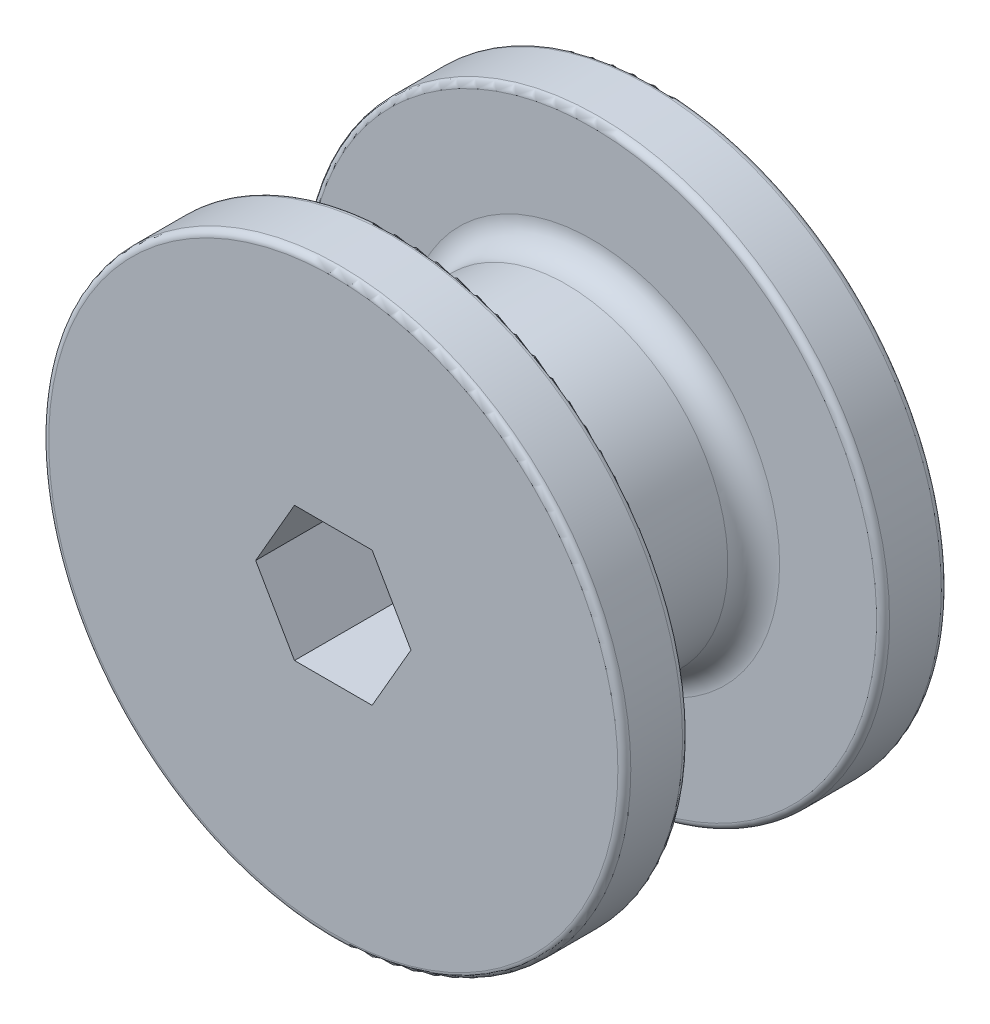
ISO-10303-21;
HEADER;
FILE_DESCRIPTION(('STEP AP214'),'2;1');
FILE_NAME('part.step','',(''),(''),'','','');
FILE_SCHEMA(('AUTOMOTIVE_DESIGN { 1 0 10303 214 1 1 1 1 }'));
ENDSEC;
DATA;
#1=APPLICATION_CONTEXT('core data for automotive mechanical design processes');
#2=APPLICATION_PROTOCOL_DEFINITION('international standard','automotive_design',2000,#1);
#3=PRODUCT_CONTEXT('',#1,'mechanical');
#4=PRODUCT('Part','Part','',(#3));
#5=PRODUCT_RELATED_PRODUCT_CATEGORY('part','',(#4));
#6=PRODUCT_DEFINITION_FORMATION('','',#4);
#7=PRODUCT_DEFINITION_CONTEXT('part definition',#1,'design');
#8=PRODUCT_DEFINITION('design','',#6,#7);
#9=PRODUCT_DEFINITION_SHAPE('','',#8);
#10=(LENGTH_UNIT() NAMED_UNIT(*) SI_UNIT(.MILLI.,.METRE.));
#11=(NAMED_UNIT(*) PLANE_ANGLE_UNIT() SI_UNIT($,.RADIAN.));
#12=(NAMED_UNIT(*) SI_UNIT($,.STERADIAN.) SOLID_ANGLE_UNIT());
#13=UNCERTAINTY_MEASURE_WITH_UNIT(LENGTH_MEASURE(1.E-05),#10,'distance_accuracy_value','');
#14=(GEOMETRIC_REPRESENTATION_CONTEXT(3) GLOBAL_UNCERTAINTY_ASSIGNED_CONTEXT((#13)) GLOBAL_UNIT_ASSIGNED_CONTEXT((#10,
#11,#12)) REPRESENTATION_CONTEXT('',''));
#15=CARTESIAN_POINT('',(0.,0.,0.));
#16=DIRECTION('',(0.,0.,1.));
#17=DIRECTION('',(1.,0.,0.));
#18=AXIS2_PLACEMENT_3D('',#15,#16,#17);
#19=CARTESIAN_POINT('',(0.,0.,19.05));
#20=DIRECTION('',(0.,0.,-1.));
#21=DIRECTION('',(-1.,0.,0.));
#22=AXIS2_PLACEMENT_3D('',#19,#20,#21);
#23=CYLINDRICAL_SURFACE('',#22,15.875);
#24=CARTESIAN_POINT('',(0.,0.,16.51));
#25=DIRECTION('',(0.,0.,1.));
#26=DIRECTION('',(1.,0.,0.));
#27=AXIS2_PLACEMENT_3D('',#24,#25,#26);
#28=CIRCLE('',#27,15.875);
#29=CARTESIAN_POINT('',(15.875,0.,16.51));
#30=VERTEX_POINT('',#29);
#31=EDGE_CURVE('E143',#30,#30,#28,.F.);
#32=ORIENTED_EDGE('',*,*,#31,.T.);
#33=EDGE_LOOP('',(#32));
#34=FACE_BOUND('',#33,.T.);
#35=CARTESIAN_POINT('',(0.,0.,2.54));
#36=DIRECTION('',(0.,0.,-1.));
#37=DIRECTION('',(-1.,0.,0.));
#38=AXIS2_PLACEMENT_3D('',#35,#36,#37);
#39=CIRCLE('',#38,15.875);
#40=CARTESIAN_POINT('',(-15.875,0.,2.54));
#41=VERTEX_POINT('',#40);
#42=EDGE_CURVE('E140',#41,#41,#39,.F.);
#43=ORIENTED_EDGE('',*,*,#42,.T.);
#44=EDGE_LOOP('',(#43));
#45=FACE_BOUND('',#44,.T.);
#46=ADVANCED_FACE('F33',(#34,#45),#23,.T.);
#47=CARTESIAN_POINT('',(0.,0.,25.4));
#48=DIRECTION('',(0.,0.,-1.));
#49=DIRECTION('',(-1.,0.,0.));
#50=AXIS2_PLACEMENT_3D('',#47,#48,#49);
#51=CYLINDRICAL_SURFACE('',#50,28.575);
#52=CARTESIAN_POINT('',(0.,0.,24.765));
#53=DIRECTION('',(0.,0.,1.));
#54=DIRECTION('',(1.,0.,0.));
#55=AXIS2_PLACEMENT_3D('',#52,#53,#54);
#56=CIRCLE('',#55,28.575);
#57=CARTESIAN_POINT('',(28.575,0.,24.765));
#58=VERTEX_POINT('',#57);
#59=EDGE_CURVE('E155',#58,#58,#56,.F.);
#60=ORIENTED_EDGE('',*,*,#59,.T.);
#61=EDGE_LOOP('',(#60));
#62=FACE_BOUND('',#61,.T.);
#63=CARTESIAN_POINT('',(0.,0.,19.685));
#64=DIRECTION('',(0.,0.,1.));
#65=DIRECTION('',(1.,0.,0.));
#66=AXIS2_PLACEMENT_3D('',#63,#64,#65);
#67=CIRCLE('',#66,28.575);
#68=CARTESIAN_POINT('',(28.575,0.,19.685));
#69=VERTEX_POINT('',#68);
#70=EDGE_CURVE('E152',#69,#69,#67,.T.);
#71=ORIENTED_EDGE('',*,*,#70,.T.);
#72=EDGE_LOOP('',(#71));
#73=FACE_BOUND('',#72,.T.);
#74=ADVANCED_FACE('F205',(#62,#73),#51,.T.);
#75=CARTESIAN_POINT('',(0.,0.,25.4));
#76=DIRECTION('',(0.,0.,1.));
#77=DIRECTION('',(1.,0.,0.));
#78=AXIS2_PLACEMENT_3D('',#75,#76,#77);
#79=PLANE('',#78);
#80=CARTESIAN_POINT('',(0.,0.,25.4));
#81=DIRECTION('',(0.,0.,1.));
#82=DIRECTION('',(1.,0.,0.));
#83=AXIS2_PLACEMENT_3D('',#80,#81,#82);
#84=CIRCLE('',#83,27.94);
#85=CARTESIAN_POINT('',(27.94,0.,25.4));
#86=VERTEX_POINT('',#85);
#87=EDGE_CURVE('E149',#86,#86,#84,.T.);
#88=ORIENTED_EDGE('',*,*,#87,.T.);
#89=EDGE_LOOP('',(#88));
#90=FACE_BOUND('',#89,.T.);
#91=DIRECTION('',(-0.5,0.866025403784439,0.));
#92=VECTOR('',#91,1.);
#93=CARTESIAN_POINT('',(-3.81051177665153,-6.6,25.4));
#94=LINE('',#93,#92);
#95=CARTESIAN_POINT('',(-3.81051177665153,-6.6,25.4));
#96=VERTEX_POINT('',#95);
#97=CARTESIAN_POINT('',(-7.62102355330306,0.,25.4));
#98=VERTEX_POINT('',#97);
#99=EDGE_CURVE('E88',#96,#98,#94,.T.);
#100=ORIENTED_EDGE('',*,*,#99,.T.);
#101=DIRECTION('',(0.5,0.866025403784438,0.));
#102=VECTOR('',#101,1.);
#103=CARTESIAN_POINT('',(-7.62102355330306,0.,25.4));
#104=LINE('',#103,#102);
#105=CARTESIAN_POINT('',(-3.81051177665153,6.6,25.4));
#106=VERTEX_POINT('',#105);
#107=EDGE_CURVE('E97',#98,#106,#104,.T.);
#108=ORIENTED_EDGE('',*,*,#107,.T.);
#109=DIRECTION('',(1.,0.,0.));
#110=VECTOR('',#109,1.);
#111=CARTESIAN_POINT('',(-3.81051177665153,6.6,25.4));
#112=LINE('',#111,#110);
#113=CARTESIAN_POINT('',(3.81051177665153,6.6,25.4));
#114=VERTEX_POINT('',#113);
#115=EDGE_CURVE('E48',#106,#114,#112,.T.);
#116=ORIENTED_EDGE('',*,*,#115,.T.);
#117=DIRECTION('',(0.5,-0.866025403784439,0.));
#118=VECTOR('',#117,1.);
#119=CARTESIAN_POINT('',(3.81051177665153,6.6,25.4));
#120=LINE('',#119,#118);
#121=CARTESIAN_POINT('',(7.62102355330306,0.,25.4));
#122=VERTEX_POINT('',#121);
#123=EDGE_CURVE('E111',#114,#122,#120,.T.);
#124=ORIENTED_EDGE('',*,*,#123,.T.);
#125=DIRECTION('',(-0.5,-0.866025403784439,0.));
#126=VECTOR('',#125,1.);
#127=CARTESIAN_POINT('',(7.62102355330306,0.,25.4));
#128=LINE('',#127,#126);
#129=CARTESIAN_POINT('',(3.81051177665153,-6.6,25.4));
#130=VERTEX_POINT('',#129);
#131=EDGE_CURVE('E114',#122,#130,#128,.T.);
#132=ORIENTED_EDGE('',*,*,#131,.T.);
#133=DIRECTION('',(-1.,0.,0.));
#134=VECTOR('',#133,1.);
#135=CARTESIAN_POINT('',(3.81051177665153,-6.6,25.4));
#136=LINE('',#135,#134);
#137=EDGE_CURVE('E94',#130,#96,#136,.T.);
#138=ORIENTED_EDGE('',*,*,#137,.T.);
#139=EDGE_LOOP('',(#100,#108,#116,#124,#132,#138));
#140=FACE_BOUND('',#139,.T.);
#141=ADVANCED_FACE('F101',(#90,#140),#79,.T.);
#142=CARTESIAN_POINT('',(0.,0.,19.05));
#143=DIRECTION('',(0.,0.,1.));
#144=DIRECTION('',(1.,0.,0.));
#145=AXIS2_PLACEMENT_3D('',#142,#143,#144);
#146=PLANE('',#145);
#147=CARTESIAN_POINT('',(0.,0.,19.05));
#148=DIRECTION('',(0.,0.,1.));
#149=DIRECTION('',(1.,0.,0.));
#150=AXIS2_PLACEMENT_3D('',#147,#148,#149);
#151=CIRCLE('',#150,27.94);
#152=CARTESIAN_POINT('',(27.94,0.,19.05));
#153=VERTEX_POINT('',#152);
#154=EDGE_CURVE('E158',#153,#153,#151,.F.);
#155=ORIENTED_EDGE('',*,*,#154,.T.);
#156=EDGE_LOOP('',(#155));
#157=FACE_BOUND('',#156,.T.);
#158=CARTESIAN_POINT('',(0.,0.,19.05));
#159=DIRECTION('',(0.,0.,1.));
#160=DIRECTION('',(1.,0.,0.));
#161=AXIS2_PLACEMENT_3D('',#158,#159,#160);
#162=CIRCLE('',#161,18.415);
#163=CARTESIAN_POINT('',(18.415,0.,19.05));
#164=VERTEX_POINT('',#163);
#165=EDGE_CURVE('E130',#164,#164,#162,.T.);
#166=ORIENTED_EDGE('',*,*,#165,.T.);
#167=EDGE_LOOP('',(#166));
#168=FACE_BOUND('',#167,.T.);
#169=ADVANCED_FACE('F239',(#157,#168),#146,.F.);
#170=CARTESIAN_POINT('',(0.,0.,-6.35));
#171=DIRECTION('',(0.,0.,1.));
#172=DIRECTION('',(1.,0.,0.));
#173=AXIS2_PLACEMENT_3D('',#170,#171,#172);
#174=CYLINDRICAL_SURFACE('',#173,28.575);
#175=CARTESIAN_POINT('',(0.,0.,-5.715));
#176=DIRECTION('',(0.,0.,-1.));
#177=DIRECTION('',(-1.,0.,0.));
#178=AXIS2_PLACEMENT_3D('',#175,#176,#177);
#179=CIRCLE('',#178,28.575);
#180=CARTESIAN_POINT('',(-28.575,0.,-5.715));
#181=VERTEX_POINT('',#180);
#182=EDGE_CURVE('E41',#181,#181,#179,.F.);
#183=ORIENTED_EDGE('',*,*,#182,.T.);
#184=EDGE_LOOP('',(#183));
#185=FACE_BOUND('',#184,.T.);
#186=CARTESIAN_POINT('',(0.,0.,-0.635));
#187=DIRECTION('',(0.,0.,-1.));
#188=DIRECTION('',(-1.,0.,0.));
#189=AXIS2_PLACEMENT_3D('',#186,#187,#188);
#190=CIRCLE('',#189,28.575);
#191=CARTESIAN_POINT('',(-28.575,0.,-0.635));
#192=VERTEX_POINT('',#191);
#193=EDGE_CURVE('E164',#192,#192,#190,.T.);
#194=ORIENTED_EDGE('',*,*,#193,.T.);
#195=EDGE_LOOP('',(#194));
#196=FACE_BOUND('',#195,.T.);
#197=ADVANCED_FACE('F169',(#185,#196),#174,.T.);
#198=CARTESIAN_POINT('',(0.,0.,-6.35));
#199=DIRECTION('',(0.,0.,-1.));
#200=DIRECTION('',(-1.,0.,0.));
#201=AXIS2_PLACEMENT_3D('',#198,#199,#200);
#202=PLANE('',#201);
#203=CARTESIAN_POINT('',(0.,0.,-6.35));
#204=DIRECTION('',(0.,0.,-1.));
#205=DIRECTION('',(-1.,0.,0.));
#206=AXIS2_PLACEMENT_3D('',#203,#204,#205);
#207=CIRCLE('',#206,27.94);
#208=CARTESIAN_POINT('',(-27.94,0.,-6.35));
#209=VERTEX_POINT('',#208);
#210=EDGE_CURVE('E161',#209,#209,#207,.T.);
#211=ORIENTED_EDGE('',*,*,#210,.T.);
#212=EDGE_LOOP('',(#211));
#213=FACE_BOUND('',#212,.T.);
#214=DIRECTION('',(-0.5,0.866025403784439,0.));
#215=VECTOR('',#214,1.);
#216=CARTESIAN_POINT('',(-3.81051177665153,-6.6,-6.35));
#217=LINE('',#216,#215);
#218=CARTESIAN_POINT('',(-3.81051177665153,-6.6,-6.35));
#219=VERTEX_POINT('',#218);
#220=CARTESIAN_POINT('',(-7.62102355330306,0.,-6.35));
#221=VERTEX_POINT('',#220);
#222=EDGE_CURVE('E56',#219,#221,#217,.T.);
#223=ORIENTED_EDGE('',*,*,#222,.F.);
#224=DIRECTION('',(-1.,0.,0.));
#225=VECTOR('',#224,1.);
#226=CARTESIAN_POINT('',(3.81051177665153,-6.6,-6.35));
#227=LINE('',#226,#225);
#228=CARTESIAN_POINT('',(3.81051177665153,-6.6,-6.35));
#229=VERTEX_POINT('',#228);
#230=EDGE_CURVE('E104',#229,#219,#227,.T.);
#231=ORIENTED_EDGE('',*,*,#230,.F.);
#232=DIRECTION('',(-0.5,-0.866025403784439,0.));
#233=VECTOR('',#232,1.);
#234=CARTESIAN_POINT('',(7.62102355330306,0.,-6.35));
#235=LINE('',#234,#233);
#236=CARTESIAN_POINT('',(7.62102355330306,0.,-6.35));
#237=VERTEX_POINT('',#236);
#238=EDGE_CURVE('E107',#237,#229,#235,.T.);
#239=ORIENTED_EDGE('',*,*,#238,.F.);
#240=DIRECTION('',(0.5,-0.866025403784439,0.));
#241=VECTOR('',#240,1.);
#242=CARTESIAN_POINT('',(3.81051177665153,6.6,-6.35));
#243=LINE('',#242,#241);
#244=CARTESIAN_POINT('',(3.81051177665153,6.6,-6.35));
#245=VERTEX_POINT('',#244);
#246=EDGE_CURVE('E123',#245,#237,#243,.T.);
#247=ORIENTED_EDGE('',*,*,#246,.F.);
#248=DIRECTION('',(1.,0.,0.));
#249=VECTOR('',#248,1.);
#250=CARTESIAN_POINT('',(-3.81051177665153,6.6,-6.35));
#251=LINE('',#250,#249);
#252=CARTESIAN_POINT('',(-3.81051177665153,6.6,-6.35));
#253=VERTEX_POINT('',#252);
#254=EDGE_CURVE('E120',#253,#245,#251,.T.);
#255=ORIENTED_EDGE('',*,*,#254,.F.);
#256=DIRECTION('',(0.5,0.866025403784438,0.));
#257=VECTOR('',#256,1.);
#258=CARTESIAN_POINT('',(-7.62102355330306,0.,-6.35));
#259=LINE('',#258,#257);
#260=EDGE_CURVE('E118',#221,#253,#259,.T.);
#261=ORIENTED_EDGE('',*,*,#260,.F.);
#262=EDGE_LOOP('',(#223,#231,#239,#247,#255,#261));
#263=FACE_BOUND('',#262,.T.);
#264=ADVANCED_FACE('F178',(#213,#263),#202,.T.);
#265=CARTESIAN_POINT('',(0.,0.,0.));
#266=DIRECTION('',(0.,0.,-1.));
#267=DIRECTION('',(-1.,0.,0.));
#268=AXIS2_PLACEMENT_3D('',#265,#266,#267);
#269=PLANE('',#268);
#270=CARTESIAN_POINT('',(0.,0.,0.));
#271=DIRECTION('',(0.,0.,-1.));
#272=DIRECTION('',(-1.,0.,0.));
#273=AXIS2_PLACEMENT_3D('',#270,#271,#272);
#274=CIRCLE('',#273,27.94);
#275=CARTESIAN_POINT('',(-27.94,0.,0.));
#276=VERTEX_POINT('',#275);
#277=EDGE_CURVE('E11',#276,#276,#274,.F.);
#278=ORIENTED_EDGE('',*,*,#277,.T.);
#279=EDGE_LOOP('',(#278));
#280=FACE_BOUND('',#279,.T.);
#281=CARTESIAN_POINT('',(0.,0.,0.));
#282=DIRECTION('',(0.,0.,-1.));
#283=DIRECTION('',(-1.,0.,0.));
#284=AXIS2_PLACEMENT_3D('',#281,#282,#283);
#285=CIRCLE('',#284,18.415);
#286=CARTESIAN_POINT('',(-18.415,0.,0.));
#287=VERTEX_POINT('',#286);
#288=EDGE_CURVE('E146',#287,#287,#285,.T.);
#289=ORIENTED_EDGE('',*,*,#288,.T.);
#290=EDGE_LOOP('',(#289));
#291=FACE_BOUND('',#290,.T.);
#292=ADVANCED_FACE('F181',(#280,#291),#269,.F.);
#293=CARTESIAN_POINT('',(-3.81051177665153,-6.6,25.4));
#294=DIRECTION('',(-0.866025403784439,-0.5,0.));
#295=DIRECTION('',(0.5,-0.866025403784439,0.));
#296=AXIS2_PLACEMENT_3D('',#293,#294,#295);
#297=PLANE('',#296);
#298=ORIENTED_EDGE('',*,*,#222,.T.);
#299=DIRECTION('',(0.,0.,-1.));
#300=VECTOR('',#299,1.);
#301=CARTESIAN_POINT('',(-7.62102355330306,0.,25.4));
#302=LINE('',#301,#300);
#303=EDGE_CURVE('E84',#98,#221,#302,.T.);
#304=ORIENTED_EDGE('',*,*,#303,.F.);
#305=ORIENTED_EDGE('',*,*,#99,.F.);
#306=DIRECTION('',(0.,0.,-1.));
#307=VECTOR('',#306,1.);
#308=CARTESIAN_POINT('',(-3.81051177665153,-6.6,25.4));
#309=LINE('',#308,#307);
#310=EDGE_CURVE('E128',#96,#219,#309,.T.);
#311=ORIENTED_EDGE('',*,*,#310,.T.);
#312=EDGE_LOOP('',(#298,#304,#305,#311));
#313=FACE_BOUND('',#312,.T.);
#314=ADVANCED_FACE('F86',(#313),#297,.F.);
#315=CARTESIAN_POINT('',(3.81051177665153,-6.6,25.4));
#316=DIRECTION('',(0.,-1.,0.));
#317=DIRECTION('',(0.,0.,-1.));
#318=AXIS2_PLACEMENT_3D('',#315,#316,#317);
#319=PLANE('',#318);
#320=ORIENTED_EDGE('',*,*,#230,.T.);
#321=ORIENTED_EDGE('',*,*,#310,.F.);
#322=ORIENTED_EDGE('',*,*,#137,.F.);
#323=DIRECTION('',(0.,0.,-1.));
#324=VECTOR('',#323,1.);
#325=CARTESIAN_POINT('',(3.81051177665153,-6.6,25.4));
#326=LINE('',#325,#324);
#327=EDGE_CURVE('E131',#130,#229,#326,.T.);
#328=ORIENTED_EDGE('',*,*,#327,.T.);
#329=EDGE_LOOP('',(#320,#321,#322,#328));
#330=FACE_BOUND('',#329,.T.);
#331=ADVANCED_FACE('F195',(#330),#319,.F.);
#332=CARTESIAN_POINT('',(7.62102355330306,0.,25.4));
#333=DIRECTION('',(0.866025403784439,-0.5,0.));
#334=DIRECTION('',(0.5,0.866025403784439,0.));
#335=AXIS2_PLACEMENT_3D('',#332,#333,#334);
#336=PLANE('',#335);
#337=ORIENTED_EDGE('',*,*,#238,.T.);
#338=ORIENTED_EDGE('',*,*,#327,.F.);
#339=ORIENTED_EDGE('',*,*,#131,.F.);
#340=DIRECTION('',(0.,0.,-1.));
#341=VECTOR('',#340,1.);
#342=CARTESIAN_POINT('',(7.62102355330306,0.,25.4));
#343=LINE('',#342,#341);
#344=EDGE_CURVE('E133',#122,#237,#343,.T.);
#345=ORIENTED_EDGE('',*,*,#344,.T.);
#346=EDGE_LOOP('',(#337,#338,#339,#345));
#347=FACE_BOUND('',#346,.T.);
#348=ADVANCED_FACE('F193',(#347),#336,.F.);
#349=CARTESIAN_POINT('',(3.81051177665153,6.6,25.4));
#350=DIRECTION('',(0.866025403784439,0.5,0.));
#351=DIRECTION('',(-0.5,0.866025403784439,0.));
#352=AXIS2_PLACEMENT_3D('',#349,#350,#351);
#353=PLANE('',#352);
#354=ORIENTED_EDGE('',*,*,#246,.T.);
#355=ORIENTED_EDGE('',*,*,#344,.F.);
#356=ORIENTED_EDGE('',*,*,#123,.F.);
#357=DIRECTION('',(0.,0.,-1.));
#358=VECTOR('',#357,1.);
#359=CARTESIAN_POINT('',(3.81051177665153,6.6,25.4));
#360=LINE('',#359,#358);
#361=EDGE_CURVE('E135',#114,#245,#360,.T.);
#362=ORIENTED_EDGE('',*,*,#361,.T.);
#363=EDGE_LOOP('',(#354,#355,#356,#362));
#364=FACE_BOUND('',#363,.T.);
#365=ADVANCED_FACE('F190',(#364),#353,.F.);
#366=CARTESIAN_POINT('',(-3.81051177665153,6.6,25.4));
#367=DIRECTION('',(0.,1.,0.));
#368=DIRECTION('',(0.,0.,1.));
#369=AXIS2_PLACEMENT_3D('',#366,#367,#368);
#370=PLANE('',#369);
#371=ORIENTED_EDGE('',*,*,#254,.T.);
#372=ORIENTED_EDGE('',*,*,#361,.F.);
#373=ORIENTED_EDGE('',*,*,#115,.F.);
#374=DIRECTION('',(0.,0.,-1.));
#375=VECTOR('',#374,1.);
#376=CARTESIAN_POINT('',(-3.81051177665153,6.6,25.4));
#377=LINE('',#376,#375);
#378=EDGE_CURVE('E93',#106,#253,#377,.T.);
#379=ORIENTED_EDGE('',*,*,#378,.T.);
#380=EDGE_LOOP('',(#371,#372,#373,#379));
#381=FACE_BOUND('',#380,.T.);
#382=ADVANCED_FACE('F187',(#381),#370,.F.);
#383=CARTESIAN_POINT('',(-7.62102355330306,0.,25.4));
#384=DIRECTION('',(-0.866025403784438,0.5,0.));
#385=DIRECTION('',(-0.5,-0.866025403784438,0.));
#386=AXIS2_PLACEMENT_3D('',#383,#384,#385);
#387=PLANE('',#386);
#388=ORIENTED_EDGE('',*,*,#260,.T.);
#389=ORIENTED_EDGE('',*,*,#378,.F.);
#390=ORIENTED_EDGE('',*,*,#107,.F.);
#391=ORIENTED_EDGE('',*,*,#303,.T.);
#392=EDGE_LOOP('',(#388,#389,#390,#391));
#393=FACE_BOUND('',#392,.T.);
#394=ADVANCED_FACE('F98',(#393),#387,.F.);
#395=CARTESIAN_POINT('',(0.,0.,16.51));
#396=DIRECTION('',(0.,0.,1.));
#397=DIRECTION('',(1.,0.,0.));
#398=AXIS2_PLACEMENT_3D('',#395,#396,#397);
#399=TOROIDAL_SURFACE('',#398,18.415,2.54);
#400=ORIENTED_EDGE('',*,*,#31,.F.);
#401=EDGE_LOOP('',(#400));
#402=FACE_BOUND('',#401,.T.);
#403=ORIENTED_EDGE('',*,*,#165,.F.);
#404=EDGE_LOOP('',(#403));
#405=FACE_BOUND('',#404,.T.);
#406=ADVANCED_FACE('F218',(#402,#405),#399,.F.);
#407=CARTESIAN_POINT('',(0.,0.,2.54));
#408=DIRECTION('',(0.,0.,-1.));
#409=DIRECTION('',(-1.,0.,0.));
#410=AXIS2_PLACEMENT_3D('',#407,#408,#409);
#411=TOROIDAL_SURFACE('',#410,18.415,2.54);
#412=ORIENTED_EDGE('',*,*,#288,.F.);
#413=EDGE_LOOP('',(#412));
#414=FACE_BOUND('',#413,.T.);
#415=ORIENTED_EDGE('',*,*,#42,.F.);
#416=EDGE_LOOP('',(#415));
#417=FACE_BOUND('',#416,.T.);
#418=ADVANCED_FACE('F221',(#414,#417),#411,.F.);
#419=CARTESIAN_POINT('',(0.,0.,24.765));
#420=DIRECTION('',(0.,0.,1.));
#421=DIRECTION('',(1.,0.,0.));
#422=AXIS2_PLACEMENT_3D('',#419,#420,#421);
#423=TOROIDAL_SURFACE('',#422,27.94,0.635);
#424=ORIENTED_EDGE('',*,*,#59,.F.);
#425=EDGE_LOOP('',(#424));
#426=FACE_BOUND('',#425,.T.);
#427=ORIENTED_EDGE('',*,*,#87,.F.);
#428=EDGE_LOOP('',(#427));
#429=FACE_BOUND('',#428,.T.);
#430=ADVANCED_FACE('F225',(#426,#429),#423,.T.);
#431=CARTESIAN_POINT('',(0.,0.,19.685));
#432=DIRECTION('',(0.,0.,1.));
#433=DIRECTION('',(1.,0.,0.));
#434=AXIS2_PLACEMENT_3D('',#431,#432,#433);
#435=TOROIDAL_SURFACE('',#434,27.94,0.635);
#436=ORIENTED_EDGE('',*,*,#154,.F.);
#437=EDGE_LOOP('',(#436));
#438=FACE_BOUND('',#437,.T.);
#439=ORIENTED_EDGE('',*,*,#70,.F.);
#440=EDGE_LOOP('',(#439));
#441=FACE_BOUND('',#440,.T.);
#442=ADVANCED_FACE('F175',(#438,#441),#435,.T.);
#443=CARTESIAN_POINT('',(0.,0.,-5.715));
#444=DIRECTION('',(0.,0.,-1.));
#445=DIRECTION('',(-1.,0.,0.));
#446=AXIS2_PLACEMENT_3D('',#443,#444,#445);
#447=TOROIDAL_SURFACE('',#446,27.94,0.635);
#448=ORIENTED_EDGE('',*,*,#182,.F.);
#449=EDGE_LOOP('',(#448));
#450=FACE_BOUND('',#449,.T.);
#451=ORIENTED_EDGE('',*,*,#210,.F.);
#452=EDGE_LOOP('',(#451));
#453=FACE_BOUND('',#452,.T.);
#454=ADVANCED_FACE('F172',(#450,#453),#447,.T.);
#455=CARTESIAN_POINT('',(0.,0.,-0.635));
#456=DIRECTION('',(0.,0.,-1.));
#457=DIRECTION('',(-1.,0.,0.));
#458=AXIS2_PLACEMENT_3D('',#455,#456,#457);
#459=TOROIDAL_SURFACE('',#458,27.94,0.635);
#460=ORIENTED_EDGE('',*,*,#277,.F.);
#461=EDGE_LOOP('',(#460));
#462=FACE_BOUND('',#461,.T.);
#463=ORIENTED_EDGE('',*,*,#193,.F.);
#464=EDGE_LOOP('',(#463));
#465=FACE_BOUND('',#464,.T.);
#466=ADVANCED_FACE('F35',(#462,#465),#459,.T.);
#467=CLOSED_SHELL('',(#46,#74,#141,#169,#197,#264,#292,#314,#331,#348,#365,#382,#394,#406,#418,
#430,#442,#454,#466));
#468=MANIFOLD_SOLID_BREP('B2',#467);
#469=ADVANCED_BREP_SHAPE_REPRESENTATION('',(#18,#468),#14);
#470=SHAPE_DEFINITION_REPRESENTATION(#9,#469);
ENDSEC;
END-ISO-10303-21;
